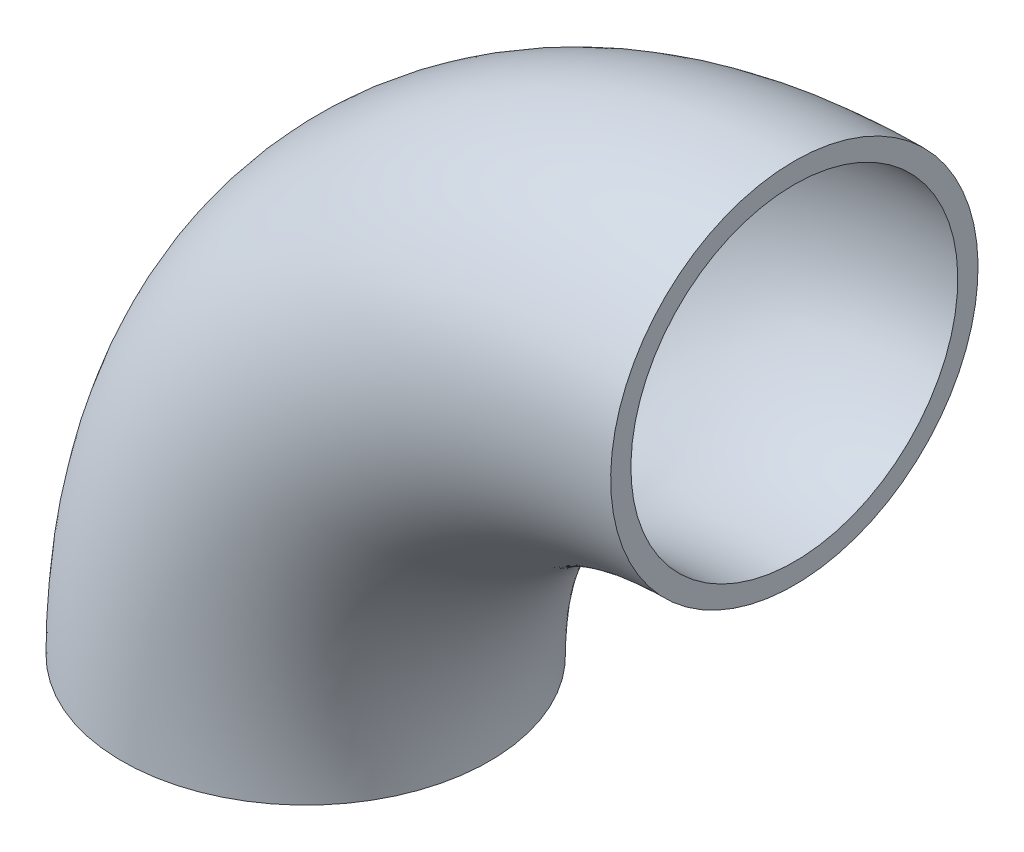
ISO-10303-21;
HEADER;
FILE_DESCRIPTION(('STEP AP214'),'2;1');
FILE_NAME('part.step','',(''),(''),'','','');
FILE_SCHEMA(('AUTOMOTIVE_DESIGN { 1 0 10303 214 1 1 1 1 }'));
ENDSEC;
DATA;
#1=APPLICATION_CONTEXT('core data for automotive mechanical design processes');
#2=APPLICATION_PROTOCOL_DEFINITION('international standard','automotive_design',2000,#1);
#3=PRODUCT_CONTEXT('',#1,'mechanical');
#4=PRODUCT('Part','Part','',(#3));
#5=PRODUCT_RELATED_PRODUCT_CATEGORY('part','',(#4));
#6=PRODUCT_DEFINITION_FORMATION('','',#4);
#7=PRODUCT_DEFINITION_CONTEXT('part definition',#1,'design');
#8=PRODUCT_DEFINITION('design','',#6,#7);
#9=PRODUCT_DEFINITION_SHAPE('','',#8);
#10=(LENGTH_UNIT() NAMED_UNIT(*) SI_UNIT(.MILLI.,.METRE.));
#11=(NAMED_UNIT(*) PLANE_ANGLE_UNIT() SI_UNIT($,.RADIAN.));
#12=(NAMED_UNIT(*) SI_UNIT($,.STERADIAN.) SOLID_ANGLE_UNIT());
#13=UNCERTAINTY_MEASURE_WITH_UNIT(LENGTH_MEASURE(1.E-05),#10,'distance_accuracy_value','');
#14=(GEOMETRIC_REPRESENTATION_CONTEXT(3) GLOBAL_UNCERTAINTY_ASSIGNED_CONTEXT((#13)) GLOBAL_UNIT_ASSIGNED_CONTEXT((#10,
#11,#12)) REPRESENTATION_CONTEXT('',''));
#15=CARTESIAN_POINT('',(0.,0.,0.));
#16=DIRECTION('',(0.,0.,1.));
#17=DIRECTION('',(1.,0.,0.));
#18=AXIS2_PLACEMENT_3D('',#15,#16,#17);
#19=CARTESIAN_POINT('',(0.,0.,0.));
#20=DIRECTION('',(0.,0.,1.));
#21=DIRECTION('',(1.,0.,0.));
#22=AXIS2_PLACEMENT_3D('',#19,#20,#21);
#23=TOROIDAL_SURFACE('',#22,152.,57.15);
#24=CARTESIAN_POINT('',(0.,152.,0.));
#25=DIRECTION('',(1.,0.,0.));
#26=DIRECTION('',(0.,0.,1.));
#27=AXIS2_PLACEMENT_3D('',#24,#25,#26);
#28=CIRCLE('',#27,57.15);
#29=CARTESIAN_POINT('',(0.,209.15,0.));
#30=VERTEX_POINT('',#29);
#31=EDGE_CURVE('E10',#30,#30,#28,.T.);
#32=CARTESIAN_POINT('',(-152.,0.,0.));
#33=DIRECTION('',(0.,1.,0.));
#34=DIRECTION('',(0.,0.,1.));
#35=AXIS2_PLACEMENT_3D('',#32,#33,#34);
#36=CIRCLE('',#35,57.15);
#37=CARTESIAN_POINT('',(-209.15,0.,0.));
#38=VERTEX_POINT('',#37);
#39=EDGE_CURVE('E40',#38,#38,#36,.T.);
#40=CARTESIAN_POINT('',(0.,0.,0.));
#41=DIRECTION('',(0.,0.,1.));
#42=DIRECTION('',(1.,0.,0.));
#43=AXIS2_PLACEMENT_3D('',#40,#41,#42);
#44=CIRCLE('',#43,209.15);
#45=EDGE_CURVE('',#30,#38,#44,.T.);
#46=ORIENTED_EDGE('',*,*,#31,.F.);
#47=ORIENTED_EDGE('',*,*,#39,.T.);
#48=ORIENTED_EDGE('',*,*,#45,.T.);
#49=ORIENTED_EDGE('',*,*,#45,.F.);
#50=EDGE_LOOP('',(#46,#48,#47,#49));
#51=FACE_BOUND('',#50,.T.);
#52=ADVANCED_FACE('F34',(#51),#23,.T.);
#53=CARTESIAN_POINT('',(0.,152.,0.));
#54=DIRECTION('',(1.,0.,0.));
#55=DIRECTION('',(0.,0.,1.));
#56=AXIS2_PLACEMENT_3D('',#53,#54,#55);
#57=PLANE('',#56);
#58=CARTESIAN_POINT('',(0.,152.,0.));
#59=DIRECTION('',(1.,0.,0.));
#60=DIRECTION('',(0.,1.,0.));
#61=AXIS2_PLACEMENT_3D('',#58,#59,#60);
#62=CIRCLE('',#61,50.85);
#63=CARTESIAN_POINT('',(0.,202.85,0.));
#64=VERTEX_POINT('',#63);
#65=EDGE_CURVE('E44',#64,#64,#62,.T.);
#66=ORIENTED_EDGE('',*,*,#65,.F.);
#67=EDGE_LOOP('',(#66));
#68=FACE_BOUND('',#67,.T.);
#69=ORIENTED_EDGE('',*,*,#31,.T.);
#70=EDGE_LOOP('',(#69));
#71=FACE_BOUND('',#70,.T.);
#72=ADVANCED_FACE('F64',(#68,#71),#57,.T.);
#73=CARTESIAN_POINT('',(-152.,0.,0.));
#74=DIRECTION('',(0.,1.,0.));
#75=DIRECTION('',(0.,0.,1.));
#76=AXIS2_PLACEMENT_3D('',#73,#74,#75);
#77=PLANE('',#76);
#78=CARTESIAN_POINT('',(-152.,0.,0.));
#79=DIRECTION('',(0.,1.,0.));
#80=DIRECTION('',(0.,0.,1.));
#81=AXIS2_PLACEMENT_3D('',#78,#79,#80);
#82=CIRCLE('',#81,50.85);
#83=CARTESIAN_POINT('',(-202.85,0.,0.));
#84=VERTEX_POINT('',#83);
#85=EDGE_CURVE('E48',#84,#84,#82,.T.);
#86=ORIENTED_EDGE('',*,*,#85,.T.);
#87=EDGE_LOOP('',(#86));
#88=FACE_BOUND('',#87,.T.);
#89=ORIENTED_EDGE('',*,*,#39,.F.);
#90=EDGE_LOOP('',(#89));
#91=FACE_BOUND('',#90,.T.);
#92=ADVANCED_FACE('F54',(#88,#91),#77,.F.);
#93=CARTESIAN_POINT('',(0.,0.,0.));
#94=DIRECTION('',(0.,0.,1.));
#95=DIRECTION('',(1.,0.,0.));
#96=AXIS2_PLACEMENT_3D('',#93,#94,#95);
#97=TOROIDAL_SURFACE('',#96,152.,50.85);
#98=CARTESIAN_POINT('',(0.,0.,0.));
#99=DIRECTION('',(0.,0.,1.));
#100=DIRECTION('',(1.,0.,0.));
#101=AXIS2_PLACEMENT_3D('',#98,#99,#100);
#102=CIRCLE('',#101,202.85);
#103=EDGE_CURVE('',#64,#84,#102,.T.);
#104=ORIENTED_EDGE('',*,*,#65,.T.);
#105=ORIENTED_EDGE('',*,*,#85,.F.);
#106=ORIENTED_EDGE('',*,*,#103,.T.);
#107=ORIENTED_EDGE('',*,*,#103,.F.);
#108=EDGE_LOOP('',(#104,#106,#105,#107));
#109=FACE_BOUND('',#108,.T.);
#110=ADVANCED_FACE('F57',(#109),#97,.F.);
#111=CLOSED_SHELL('',(#52,#72,#92,#110));
#112=MANIFOLD_SOLID_BREP('B2',#111);
#113=ADVANCED_BREP_SHAPE_REPRESENTATION('',(#18,#112),#14);
#114=SHAPE_DEFINITION_REPRESENTATION(#9,#113);
ENDSEC;
END-ISO-10303-21;
